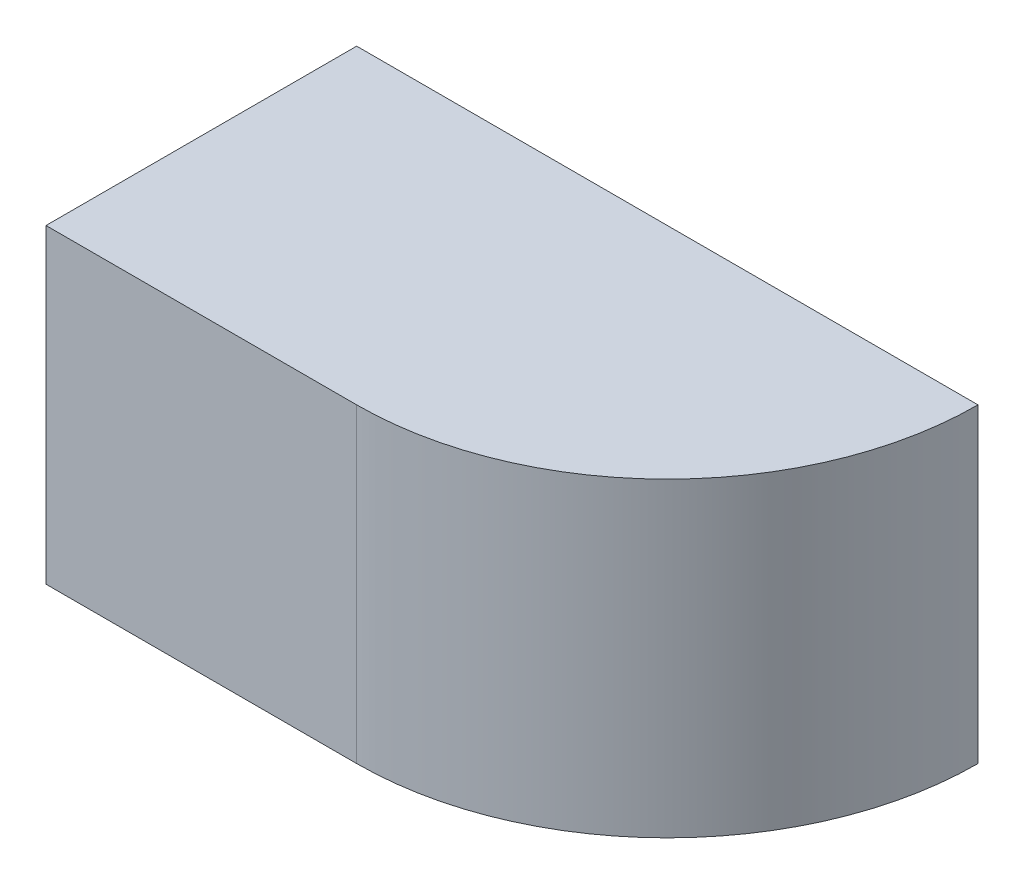
ISO-10303-21;
HEADER;
FILE_DESCRIPTION(('STEP AP214'),'2;1');
FILE_NAME('part.step','',(''),(''),'','','');
FILE_SCHEMA(('AUTOMOTIVE_DESIGN { 1 0 10303 214 1 1 1 1 }'));
ENDSEC;
DATA;
#1=APPLICATION_CONTEXT('core data for automotive mechanical design processes');
#2=APPLICATION_PROTOCOL_DEFINITION('international standard','automotive_design',2000,#1);
#3=PRODUCT_CONTEXT('',#1,'mechanical');
#4=PRODUCT('Part','Part','',(#3));
#5=PRODUCT_RELATED_PRODUCT_CATEGORY('part','',(#4));
#6=PRODUCT_DEFINITION_FORMATION('','',#4);
#7=PRODUCT_DEFINITION_CONTEXT('part definition',#1,'design');
#8=PRODUCT_DEFINITION('design','',#6,#7);
#9=PRODUCT_DEFINITION_SHAPE('','',#8);
#10=(LENGTH_UNIT() NAMED_UNIT(*) SI_UNIT(.MILLI.,.METRE.));
#11=(NAMED_UNIT(*) PLANE_ANGLE_UNIT() SI_UNIT($,.RADIAN.));
#12=(NAMED_UNIT(*) SI_UNIT($,.STERADIAN.) SOLID_ANGLE_UNIT());
#13=UNCERTAINTY_MEASURE_WITH_UNIT(LENGTH_MEASURE(1.E-05),#10,'distance_accuracy_value','');
#14=(GEOMETRIC_REPRESENTATION_CONTEXT(3) GLOBAL_UNCERTAINTY_ASSIGNED_CONTEXT((#13)) GLOBAL_UNIT_ASSIGNED_CONTEXT((#10,
#11,#12)) REPRESENTATION_CONTEXT('',''));
#15=CARTESIAN_POINT('',(0.,0.,0.));
#16=DIRECTION('',(0.,0.,1.));
#17=DIRECTION('',(1.,0.,0.));
#18=AXIS2_PLACEMENT_3D('',#15,#16,#17);
#19=CARTESIAN_POINT('',(2.00000002980232,-2.75000013038516,2.));
#20=DIRECTION('',(0.,0.,1.));
#21=DIRECTION('',(1.,0.,0.));
#22=AXIS2_PLACEMENT_3D('',#19,#20,#21);
#23=PLANE('',#22);
#24=DIRECTION('',(0.,-1.,0.));
#25=VECTOR('',#24,1.);
#26=CARTESIAN_POINT('',(1.50000002235174,-2.50000012665987,2.));
#27=LINE('',#26,#25);
#28=CARTESIAN_POINT('',(1.50000002235174,-2.50000012665987,2.));
#29=VERTEX_POINT('',#28);
#30=CARTESIAN_POINT('',(1.50000002235174,-3.00000013411045,2.));
#31=VERTEX_POINT('',#30);
#32=EDGE_CURVE('E11',#29,#31,#27,.T.);
#33=ORIENTED_EDGE('',*,*,#32,.F.);
#34=DIRECTION('',(-1.,0.,0.));
#35=VECTOR('',#34,1.);
#36=CARTESIAN_POINT('',(2.5000000372529,-2.50000012665987,2.));
#37=LINE('',#36,#35);
#38=CARTESIAN_POINT('',(2.5000000372529,-2.50000012665987,2.));
#39=VERTEX_POINT('',#38);
#40=EDGE_CURVE('E67',#39,#29,#37,.T.);
#41=ORIENTED_EDGE('',*,*,#40,.F.);
#42=DIRECTION('',(0.,1.,0.));
#43=VECTOR('',#42,1.);
#44=CARTESIAN_POINT('',(2.5000000372529,-3.00000013411045,2.));
#45=LINE('',#44,#43);
#46=CARTESIAN_POINT('',(2.5000000372529,-3.00000013411045,2.));
#47=VERTEX_POINT('',#46);
#48=EDGE_CURVE('E69',#47,#39,#45,.T.);
#49=ORIENTED_EDGE('',*,*,#48,.F.);
#50=DIRECTION('',(1.,0.,0.));
#51=VECTOR('',#50,1.);
#52=CARTESIAN_POINT('',(1.50000002235174,-3.00000013411045,2.));
#53=LINE('',#52,#51);
#54=EDGE_CURVE('E28',#31,#47,#53,.T.);
#55=ORIENTED_EDGE('',*,*,#54,.F.);
#56=EDGE_LOOP('',(#33,#41,#49,#55));
#57=FACE_BOUND('',#56,.T.);
#58=ADVANCED_FACE('F17',(#57),#23,.F.);
#59=CARTESIAN_POINT('',(1.50000002235174,-2.50000012665987,2.));
#60=DIRECTION('',(-1.,0.,0.));
#61=DIRECTION('',(0.,0.,1.));
#62=AXIS2_PLACEMENT_3D('',#59,#60,#61);
#63=PLANE('',#62);
#64=ORIENTED_EDGE('',*,*,#32,.T.);
#65=DIRECTION('',(0.,0.,1.));
#66=VECTOR('',#65,1.);
#67=CARTESIAN_POINT('',(1.50000002235174,-3.00000013411045,2.));
#68=LINE('',#67,#66);
#69=CARTESIAN_POINT('',(1.50000002235174,-3.00000013411045,2.5));
#70=VERTEX_POINT('',#69);
#71=EDGE_CURVE('E97',#31,#70,#68,.T.);
#72=ORIENTED_EDGE('',*,*,#71,.T.);
#73=DIRECTION('',(0.,-1.,0.));
#74=VECTOR('',#73,1.);
#75=CARTESIAN_POINT('',(1.50000002235174,-2.50000012665987,2.5));
#76=LINE('',#75,#74);
#77=CARTESIAN_POINT('',(1.50000002235174,-2.50000012665987,2.5));
#78=VERTEX_POINT('',#77);
#79=EDGE_CURVE('E99',#78,#70,#76,.T.);
#80=ORIENTED_EDGE('',*,*,#79,.F.);
#81=DIRECTION('',(0.,0.,1.));
#82=VECTOR('',#81,1.);
#83=CARTESIAN_POINT('',(1.50000002235174,-2.50000012665987,2.));
#84=LINE('',#83,#82);
#85=EDGE_CURVE('E21',#29,#78,#84,.T.);
#86=ORIENTED_EDGE('',*,*,#85,.F.);
#87=EDGE_LOOP('',(#64,#72,#80,#86));
#88=FACE_BOUND('',#87,.T.);
#89=ADVANCED_FACE('F115',(#88),#63,.T.);
#90=CARTESIAN_POINT('',(1.50000002235174,-3.00000013411045,2.));
#91=DIRECTION('',(0.,-1.,0.));
#92=DIRECTION('',(0.,0.,-1.));
#93=AXIS2_PLACEMENT_3D('',#90,#91,#92);
#94=PLANE('',#93);
#95=CARTESIAN_POINT('',(2.0000000372529,-3.00000013411045,2.));
#96=DIRECTION('',(0.,1.,0.));
#97=DIRECTION('',(0.707106781186548,0.,0.707106781186548));
#98=AXIS2_PLACEMENT_3D('',#95,#96,#97);
#99=CIRCLE('',#98,0.5);
#100=CARTESIAN_POINT('',(2.0000000372529,-3.00000013411045,2.5));
#101=VERTEX_POINT('',#100);
#102=EDGE_CURVE('E81',#101,#47,#99,.T.);
#103=ORIENTED_EDGE('',*,*,#102,.F.);
#104=DIRECTION('',(1.,0.,0.));
#105=VECTOR('',#104,1.);
#106=CARTESIAN_POINT('',(1.50000002235174,-3.00000013411045,2.5));
#107=LINE('',#106,#105);
#108=EDGE_CURVE('E74',#70,#101,#107,.T.);
#109=ORIENTED_EDGE('',*,*,#108,.F.);
#110=ORIENTED_EDGE('',*,*,#71,.F.);
#111=ORIENTED_EDGE('',*,*,#54,.T.);
#112=EDGE_LOOP('',(#103,#109,#110,#111));
#113=FACE_BOUND('',#112,.T.);
#114=ADVANCED_FACE('F126',(#113),#94,.T.);
#115=CARTESIAN_POINT('',(2.5000000372529,-2.50000012665987,2.));
#116=DIRECTION('',(0.,1.,0.));
#117=DIRECTION('',(1.,0.,0.));
#118=AXIS2_PLACEMENT_3D('',#115,#116,#117);
#119=PLANE('',#118);
#120=CARTESIAN_POINT('',(2.0000000372529,-2.50000012665987,2.));
#121=DIRECTION('',(0.,-1.,0.));
#122=DIRECTION('',(0.707106781186548,0.,0.707106781186548));
#123=AXIS2_PLACEMENT_3D('',#120,#121,#122);
#124=CIRCLE('',#123,0.5);
#125=CARTESIAN_POINT('',(2.0000000372529,-2.50000012665987,2.5));
#126=VERTEX_POINT('',#125);
#127=EDGE_CURVE('E79',#39,#126,#124,.T.);
#128=ORIENTED_EDGE('',*,*,#127,.F.);
#129=ORIENTED_EDGE('',*,*,#40,.T.);
#130=ORIENTED_EDGE('',*,*,#85,.T.);
#131=DIRECTION('',(-1.,0.,0.));
#132=VECTOR('',#131,1.);
#133=CARTESIAN_POINT('',(2.5000000372529,-2.50000012665987,2.5));
#134=LINE('',#133,#132);
#135=EDGE_CURVE('E83',#126,#78,#134,.T.);
#136=ORIENTED_EDGE('',*,*,#135,.F.);
#137=EDGE_LOOP('',(#128,#129,#130,#136));
#138=FACE_BOUND('',#137,.T.);
#139=ADVANCED_FACE('F85',(#138),#119,.T.);
#140=CARTESIAN_POINT('',(2.00000002980232,-2.75000013038516,2.5));
#141=DIRECTION('',(0.,0.,1.));
#142=DIRECTION('',(1.,0.,0.));
#143=AXIS2_PLACEMENT_3D('',#140,#141,#142);
#144=PLANE('',#143);
#145=DIRECTION('',(0.,-1.,0.));
#146=VECTOR('',#145,1.);
#147=CARTESIAN_POINT('',(2.0000000372529,-2.8750001322478,2.5));
#148=LINE('',#147,#146);
#149=EDGE_CURVE('E89',#126,#101,#148,.T.);
#150=ORIENTED_EDGE('',*,*,#149,.F.);
#151=ORIENTED_EDGE('',*,*,#135,.T.);
#152=ORIENTED_EDGE('',*,*,#79,.T.);
#153=ORIENTED_EDGE('',*,*,#108,.T.);
#154=EDGE_LOOP('',(#150,#151,#152,#153));
#155=FACE_BOUND('',#154,.T.);
#156=ADVANCED_FACE('F117',(#155),#144,.T.);
#157=CARTESIAN_POINT('',(2.0000000372529,-2.8750001322478,2.));
#158=DIRECTION('',(0.,1.,0.));
#159=DIRECTION('',(0.707106781186548,0.,0.707106781186548));
#160=AXIS2_PLACEMENT_3D('',#157,#158,#159);
#161=CYLINDRICAL_SURFACE('',#160,0.5);
#162=ORIENTED_EDGE('',*,*,#127,.T.);
#163=ORIENTED_EDGE('',*,*,#149,.T.);
#164=ORIENTED_EDGE('',*,*,#102,.T.);
#165=ORIENTED_EDGE('',*,*,#48,.T.);
#166=EDGE_LOOP('',(#162,#163,#164,#165));
#167=FACE_BOUND('',#166,.T.);
#168=ADVANCED_FACE('F19',(#167),#161,.T.);
#169=CLOSED_SHELL('',(#58,#89,#114,#139,#156,#168));
#170=MANIFOLD_SOLID_BREP('B1',#169);
#171=ADVANCED_BREP_SHAPE_REPRESENTATION('',(#18,#170),#14);
#172=SHAPE_DEFINITION_REPRESENTATION(#9,#171);
ENDSEC;
END-ISO-10303-21;
